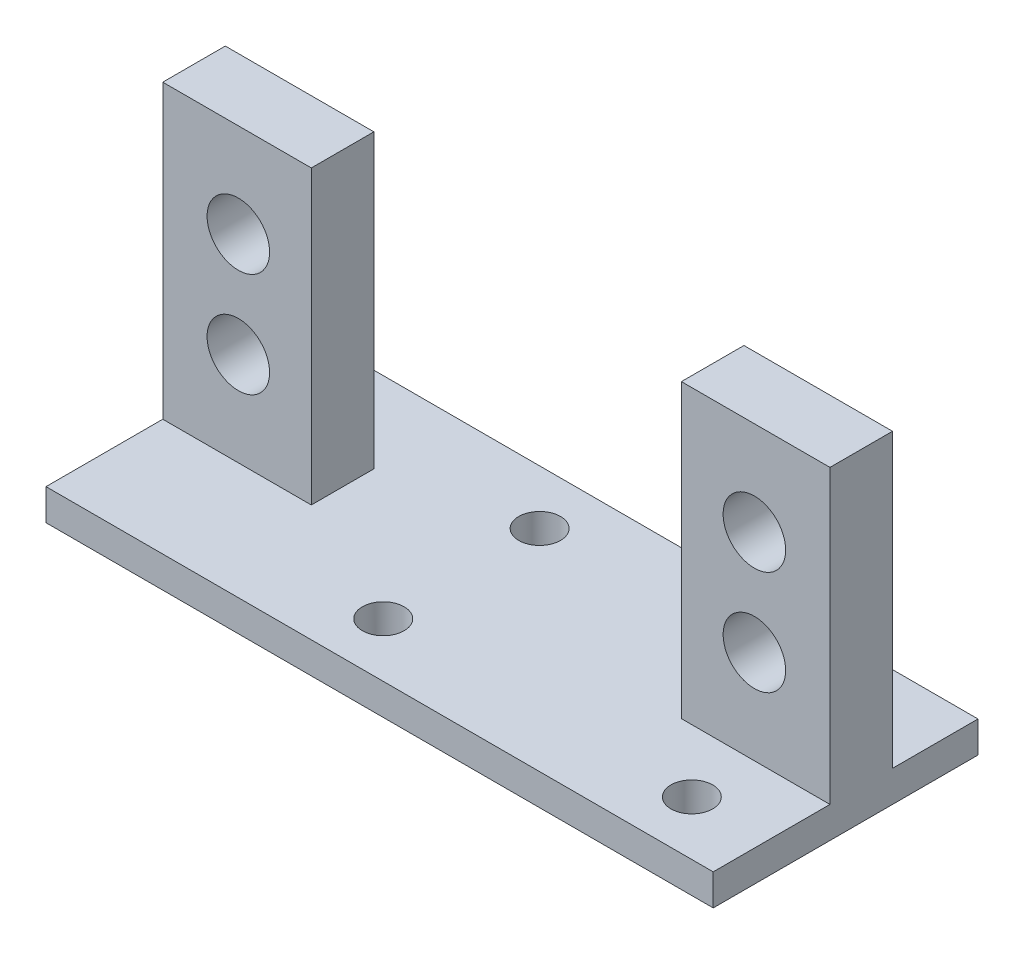
ISO-10303-21;
HEADER;
FILE_DESCRIPTION(('STEP AP214'),'2;1');
FILE_NAME('part.step','',(''),(''),'','','');
FILE_SCHEMA(('AUTOMOTIVE_DESIGN { 1 0 10303 214 1 1 1 1 }'));
ENDSEC;
DATA;
#1=APPLICATION_CONTEXT('core data for automotive mechanical design processes');
#2=APPLICATION_PROTOCOL_DEFINITION('international standard','automotive_design',2000,#1);
#3=PRODUCT_CONTEXT('',#1,'mechanical');
#4=PRODUCT('Part','Part','',(#3));
#5=PRODUCT_RELATED_PRODUCT_CATEGORY('part','',(#4));
#6=PRODUCT_DEFINITION_FORMATION('','',#4);
#7=PRODUCT_DEFINITION_CONTEXT('part definition',#1,'design');
#8=PRODUCT_DEFINITION('design','',#6,#7);
#9=PRODUCT_DEFINITION_SHAPE('','',#8);
#10=(LENGTH_UNIT() NAMED_UNIT(*) SI_UNIT(.MILLI.,.METRE.));
#11=(NAMED_UNIT(*) PLANE_ANGLE_UNIT() SI_UNIT($,.RADIAN.));
#12=(NAMED_UNIT(*) SI_UNIT($,.STERADIAN.) SOLID_ANGLE_UNIT());
#13=UNCERTAINTY_MEASURE_WITH_UNIT(LENGTH_MEASURE(1.E-05),#10,'distance_accuracy_value','');
#14=(GEOMETRIC_REPRESENTATION_CONTEXT(3) GLOBAL_UNCERTAINTY_ASSIGNED_CONTEXT((#13)) GLOBAL_UNIT_ASSIGNED_CONTEXT((#10,
#11,#12)) REPRESENTATION_CONTEXT('',''));
#15=CARTESIAN_POINT('',(0.,0.,0.));
#16=DIRECTION('',(0.,0.,1.));
#17=DIRECTION('',(1.,0.,0.));
#18=AXIS2_PLACEMENT_3D('',#15,#16,#17);
#19=CARTESIAN_POINT('',(0.,3.,0.));
#20=DIRECTION('',(0.,1.,0.));
#21=DIRECTION('',(0.,0.,1.));
#22=AXIS2_PLACEMENT_3D('',#19,#20,#21);
#23=PLANE('',#22);
#24=CARTESIAN_POINT('',(-4.85,3.,7.5));
#25=DIRECTION('',(0.,1.,0.));
#26=DIRECTION('',(0.,0.,-1.));
#27=AXIS2_PLACEMENT_3D('',#24,#25,#26);
#28=CIRCLE('',#27,2.);
#29=CARTESIAN_POINT('',(-4.85,3.,5.5));
#30=VERTEX_POINT('',#29);
#31=EDGE_CURVE('E263',#30,#30,#28,.T.);
#32=ORIENTED_EDGE('',*,*,#31,.F.);
#33=EDGE_LOOP('',(#32));
#34=FACE_BOUND('',#33,.T.);
#35=CARTESIAN_POINT('',(24.75,3.,-7.5));
#36=DIRECTION('',(0.,1.,0.));
#37=DIRECTION('',(0.,0.,-1.));
#38=AXIS2_PLACEMENT_3D('',#35,#36,#37);
#39=CIRCLE('',#38,2.);
#40=CARTESIAN_POINT('',(24.75,3.,-9.5));
#41=VERTEX_POINT('',#40);
#42=EDGE_CURVE('E269',#41,#41,#39,.T.);
#43=ORIENTED_EDGE('',*,*,#42,.F.);
#44=EDGE_LOOP('',(#43));
#45=FACE_BOUND('',#44,.T.);
#46=CARTESIAN_POINT('',(24.75,3.,7.5));
#47=DIRECTION('',(0.,1.,0.));
#48=DIRECTION('',(0.,0.,1.));
#49=AXIS2_PLACEMENT_3D('',#46,#47,#48);
#50=CIRCLE('',#49,2.);
#51=CARTESIAN_POINT('',(24.75,3.,9.5));
#52=VERTEX_POINT('',#51);
#53=EDGE_CURVE('E264',#52,#52,#50,.T.);
#54=ORIENTED_EDGE('',*,*,#53,.F.);
#55=EDGE_LOOP('',(#54));
#56=FACE_BOUND('',#55,.T.);
#57=CARTESIAN_POINT('',(-4.85,3.,-7.5));
#58=DIRECTION('',(0.,1.,0.));
#59=DIRECTION('',(0.,0.,1.));
#60=AXIS2_PLACEMENT_3D('',#57,#58,#59);
#61=CIRCLE('',#60,2.);
#62=CARTESIAN_POINT('',(-4.85,3.,-5.5));
#63=VERTEX_POINT('',#62);
#64=EDGE_CURVE('E268',#63,#63,#61,.T.);
#65=ORIENTED_EDGE('',*,*,#64,.F.);
#66=EDGE_LOOP('',(#65));
#67=FACE_BOUND('',#66,.T.);
#68=DIRECTION('',(-1.,0.,0.));
#69=VECTOR('',#68,1.);
#70=CARTESIAN_POINT('',(-29.,3.,-12.7));
#71=LINE('',#70,#69);
#72=CARTESIAN_POINT('',(32.,3.,-12.7));
#73=VERTEX_POINT('',#72);
#74=CARTESIAN_POINT('',(-32.,3.,-12.7));
#75=VERTEX_POINT('',#74);
#76=EDGE_CURVE('E49',#73,#75,#71,.T.);
#77=ORIENTED_EDGE('',*,*,#76,.T.);
#78=DIRECTION('',(0.,0.,-1.));
#79=VECTOR('',#78,1.);
#80=CARTESIAN_POINT('',(-32.,3.,-12.7));
#81=LINE('',#80,#79);
#82=CARTESIAN_POINT('',(-32.,3.,-4.5));
#83=VERTEX_POINT('',#82);
#84=EDGE_CURVE('E180',#83,#75,#81,.T.);
#85=ORIENTED_EDGE('',*,*,#84,.F.);
#86=DIRECTION('',(-1.,0.,0.));
#87=VECTOR('',#86,1.);
#88=CARTESIAN_POINT('',(-28.75,3.,-4.5));
#89=LINE('',#88,#87);
#90=CARTESIAN_POINT('',(-17.75,3.,-4.5));
#91=VERTEX_POINT('',#90);
#92=EDGE_CURVE('E244',#91,#83,#89,.T.);
#93=ORIENTED_EDGE('',*,*,#92,.F.);
#94=DIRECTION('',(0.,0.,-1.));
#95=VECTOR('',#94,1.);
#96=CARTESIAN_POINT('',(-17.75,3.,-4.5));
#97=LINE('',#96,#95);
#98=CARTESIAN_POINT('',(-17.75,3.,1.5));
#99=VERTEX_POINT('',#98);
#100=EDGE_CURVE('E212',#99,#91,#97,.T.);
#101=ORIENTED_EDGE('',*,*,#100,.F.);
#102=DIRECTION('',(1.,0.,0.));
#103=VECTOR('',#102,1.);
#104=CARTESIAN_POINT('',(-20.75,3.,1.5));
#105=LINE('',#104,#103);
#106=CARTESIAN_POINT('',(-32.,3.,1.5));
#107=VERTEX_POINT('',#106);
#108=EDGE_CURVE('E290',#107,#99,#105,.T.);
#109=ORIENTED_EDGE('',*,*,#108,.F.);
#110=DIRECTION('',(0.,0.,-1.));
#111=VECTOR('',#110,1.);
#112=CARTESIAN_POINT('',(-32.,3.,1.5));
#113=LINE('',#112,#111);
#114=CARTESIAN_POINT('',(-32.,3.,12.7));
#115=VERTEX_POINT('',#114);
#116=EDGE_CURVE('E196',#115,#107,#113,.T.);
#117=ORIENTED_EDGE('',*,*,#116,.F.);
#118=DIRECTION('',(1.,0.,0.));
#119=VECTOR('',#118,1.);
#120=CARTESIAN_POINT('',(-29.,3.,12.7));
#121=LINE('',#120,#119);
#122=CARTESIAN_POINT('',(32.,3.,12.7));
#123=VERTEX_POINT('',#122);
#124=EDGE_CURVE('E11',#115,#123,#121,.T.);
#125=ORIENTED_EDGE('',*,*,#124,.T.);
#126=DIRECTION('',(0.,0.,1.));
#127=VECTOR('',#126,1.);
#128=CARTESIAN_POINT('',(32.,3.,12.7));
#129=LINE('',#128,#127);
#130=CARTESIAN_POINT('',(32.,3.,1.5));
#131=VERTEX_POINT('',#130);
#132=EDGE_CURVE('E142',#131,#123,#129,.T.);
#133=ORIENTED_EDGE('',*,*,#132,.F.);
#134=DIRECTION('',(1.,0.,0.));
#135=VECTOR('',#134,1.);
#136=CARTESIAN_POINT('',(20.75,3.,1.5));
#137=LINE('',#136,#135);
#138=CARTESIAN_POINT('',(17.75,3.,1.5));
#139=VERTEX_POINT('',#138);
#140=EDGE_CURVE('E129',#139,#131,#137,.T.);
#141=ORIENTED_EDGE('',*,*,#140,.F.);
#142=DIRECTION('',(0.,0.,1.));
#143=VECTOR('',#142,1.);
#144=CARTESIAN_POINT('',(17.75,3.,1.5));
#145=LINE('',#144,#143);
#146=CARTESIAN_POINT('',(17.75,3.,-4.5));
#147=VERTEX_POINT('',#146);
#148=EDGE_CURVE('E228',#147,#139,#145,.T.);
#149=ORIENTED_EDGE('',*,*,#148,.F.);
#150=DIRECTION('',(-1.,0.,0.));
#151=VECTOR('',#150,1.);
#152=CARTESIAN_POINT('',(20.75,3.,-4.5));
#153=LINE('',#152,#151);
#154=CARTESIAN_POINT('',(32.,3.,-4.5));
#155=VERTEX_POINT('',#154);
#156=EDGE_CURVE('E258',#155,#147,#153,.T.);
#157=ORIENTED_EDGE('',*,*,#156,.F.);
#158=DIRECTION('',(0.,0.,1.));
#159=VECTOR('',#158,1.);
#160=CARTESIAN_POINT('',(32.,3.,-4.5));
#161=LINE('',#160,#159);
#162=EDGE_CURVE('E167',#73,#155,#161,.T.);
#163=ORIENTED_EDGE('',*,*,#162,.F.);
#164=EDGE_LOOP('',(#77,#85,#93,#101,#109,#117,#125,#133,#141,#149,#157,#163));
#165=FACE_BOUND('',#164,.T.);
#166=ADVANCED_FACE('F39',(#34,#45,#56,#67,#165),#23,.T.);
#167=CARTESIAN_POINT('',(-29.,3.,-12.7));
#168=DIRECTION('',(0.,0.,1.));
#169=DIRECTION('',(1.,0.,0.));
#170=AXIS2_PLACEMENT_3D('',#167,#168,#169);
#171=PLANE('',#170);
#172=DIRECTION('',(-1.,0.,0.));
#173=VECTOR('',#172,1.);
#174=CARTESIAN_POINT('',(-29.,0.,-12.7));
#175=LINE('',#174,#173);
#176=CARTESIAN_POINT('',(32.,0.,-12.7));
#177=VERTEX_POINT('',#176);
#178=CARTESIAN_POINT('',(-32.,0.,-12.7));
#179=VERTEX_POINT('',#178);
#180=EDGE_CURVE('E295',#177,#179,#175,.T.);
#181=ORIENTED_EDGE('',*,*,#180,.T.);
#182=DIRECTION('',(0.,-1.,0.));
#183=VECTOR('',#182,1.);
#184=CARTESIAN_POINT('',(-32.,0.,-12.7));
#185=LINE('',#184,#183);
#186=EDGE_CURVE('E184',#75,#179,#185,.T.);
#187=ORIENTED_EDGE('',*,*,#186,.F.);
#188=ORIENTED_EDGE('',*,*,#76,.F.);
#189=DIRECTION('',(0.,1.,0.));
#190=VECTOR('',#189,1.);
#191=CARTESIAN_POINT('',(32.,3.,-12.7));
#192=LINE('',#191,#190);
#193=EDGE_CURVE('E163',#177,#73,#192,.T.);
#194=ORIENTED_EDGE('',*,*,#193,.F.);
#195=EDGE_LOOP('',(#181,#187,#188,#194));
#196=FACE_BOUND('',#195,.T.);
#197=ADVANCED_FACE('F41',(#196),#171,.F.);
#198=CARTESIAN_POINT('',(-29.,3.,12.7));
#199=DIRECTION('',(0.,0.,-1.));
#200=DIRECTION('',(-1.,0.,0.));
#201=AXIS2_PLACEMENT_3D('',#198,#199,#200);
#202=PLANE('',#201);
#203=DIRECTION('',(1.,0.,0.));
#204=VECTOR('',#203,1.);
#205=CARTESIAN_POINT('',(-29.,0.,12.7));
#206=LINE('',#205,#204);
#207=CARTESIAN_POINT('',(-32.,0.,12.7));
#208=VERTEX_POINT('',#207);
#209=CARTESIAN_POINT('',(32.,0.,12.7));
#210=VERTEX_POINT('',#209);
#211=EDGE_CURVE('E299',#208,#210,#206,.T.);
#212=ORIENTED_EDGE('',*,*,#211,.T.);
#213=DIRECTION('',(0.,-1.,0.));
#214=VECTOR('',#213,1.);
#215=CARTESIAN_POINT('',(32.,0.,12.7));
#216=LINE('',#215,#214);
#217=EDGE_CURVE('E148',#123,#210,#216,.T.);
#218=ORIENTED_EDGE('',*,*,#217,.F.);
#219=ORIENTED_EDGE('',*,*,#124,.F.);
#220=DIRECTION('',(0.,1.,0.));
#221=VECTOR('',#220,1.);
#222=CARTESIAN_POINT('',(-32.,3.,12.7));
#223=LINE('',#222,#221);
#224=EDGE_CURVE('E192',#208,#115,#223,.T.);
#225=ORIENTED_EDGE('',*,*,#224,.F.);
#226=EDGE_LOOP('',(#212,#218,#219,#225));
#227=FACE_BOUND('',#226,.T.);
#228=ADVANCED_FACE('F351',(#227),#202,.F.);
#229=CARTESIAN_POINT('',(0.,0.,0.));
#230=DIRECTION('',(0.,1.,0.));
#231=DIRECTION('',(0.,0.,1.));
#232=AXIS2_PLACEMENT_3D('',#229,#230,#231);
#233=PLANE('',#232);
#234=CARTESIAN_POINT('',(-4.85,0.,7.5));
#235=DIRECTION('',(0.,1.,0.));
#236=DIRECTION('',(0.,0.,1.));
#237=AXIS2_PLACEMENT_3D('',#234,#235,#236);
#238=CIRCLE('',#237,2.);
#239=CARTESIAN_POINT('',(-4.85,0.,9.5));
#240=VERTEX_POINT('',#239);
#241=EDGE_CURVE('E43',#240,#240,#238,.T.);
#242=ORIENTED_EDGE('',*,*,#241,.T.);
#243=EDGE_LOOP('',(#242));
#244=FACE_BOUND('',#243,.T.);
#245=CARTESIAN_POINT('',(24.75,0.,-7.5));
#246=DIRECTION('',(0.,1.,0.));
#247=DIRECTION('',(0.,0.,1.));
#248=AXIS2_PLACEMENT_3D('',#245,#246,#247);
#249=CIRCLE('',#248,2.);
#250=CARTESIAN_POINT('',(24.75,0.,-5.5));
#251=VERTEX_POINT('',#250);
#252=EDGE_CURVE('E317',#251,#251,#249,.T.);
#253=ORIENTED_EDGE('',*,*,#252,.T.);
#254=EDGE_LOOP('',(#253));
#255=FACE_BOUND('',#254,.T.);
#256=CARTESIAN_POINT('',(24.75,0.,7.5));
#257=DIRECTION('',(0.,1.,0.));
#258=DIRECTION('',(0.,0.,1.));
#259=AXIS2_PLACEMENT_3D('',#256,#257,#258);
#260=CIRCLE('',#259,2.);
#261=CARTESIAN_POINT('',(24.75,0.,9.5));
#262=VERTEX_POINT('',#261);
#263=EDGE_CURVE('E314',#262,#262,#260,.T.);
#264=ORIENTED_EDGE('',*,*,#263,.T.);
#265=EDGE_LOOP('',(#264));
#266=FACE_BOUND('',#265,.T.);
#267=CARTESIAN_POINT('',(-4.85,0.,-7.5));
#268=DIRECTION('',(0.,1.,0.));
#269=DIRECTION('',(0.,0.,1.));
#270=AXIS2_PLACEMENT_3D('',#267,#268,#269);
#271=CIRCLE('',#270,2.);
#272=CARTESIAN_POINT('',(-4.85,0.,-5.5));
#273=VERTEX_POINT('',#272);
#274=EDGE_CURVE('E279',#273,#273,#271,.T.);
#275=ORIENTED_EDGE('',*,*,#274,.T.);
#276=EDGE_LOOP('',(#275));
#277=FACE_BOUND('',#276,.T.);
#278=ORIENTED_EDGE('',*,*,#180,.F.);
#279=DIRECTION('',(0.,0.,-1.));
#280=VECTOR('',#279,1.);
#281=CARTESIAN_POINT('',(32.,0.,-12.7));
#282=LINE('',#281,#280);
#283=EDGE_CURVE('E159',#210,#177,#282,.T.);
#284=ORIENTED_EDGE('',*,*,#283,.F.);
#285=ORIENTED_EDGE('',*,*,#211,.F.);
#286=DIRECTION('',(0.,0.,1.));
#287=VECTOR('',#286,1.);
#288=CARTESIAN_POINT('',(-32.,0.,12.7));
#289=LINE('',#288,#287);
#290=EDGE_CURVE('E188',#179,#208,#289,.T.);
#291=ORIENTED_EDGE('',*,*,#290,.F.);
#292=EDGE_LOOP('',(#278,#284,#285,#291));
#293=FACE_BOUND('',#292,.T.);
#294=ADVANCED_FACE('F326',(#244,#255,#266,#277,#293),#233,.F.);
#295=CARTESIAN_POINT('',(-20.75,31.,1.5));
#296=DIRECTION('',(0.,0.,-1.));
#297=DIRECTION('',(-1.,0.,0.));
#298=AXIS2_PLACEMENT_3D('',#295,#296,#297);
#299=PLANE('',#298);
#300=CARTESIAN_POINT('',(-24.75,22.,1.5));
#301=DIRECTION('',(0.,0.,-1.));
#302=DIRECTION('',(-1.,0.,0.));
#303=AXIS2_PLACEMENT_3D('',#300,#301,#302);
#304=CIRCLE('',#303,3.);
#305=CARTESIAN_POINT('',(-27.75,22.,1.5));
#306=VERTEX_POINT('',#305);
#307=EDGE_CURVE('E139',#306,#306,#304,.T.);
#308=ORIENTED_EDGE('',*,*,#307,.T.);
#309=EDGE_LOOP('',(#308));
#310=FACE_BOUND('',#309,.T.);
#311=CARTESIAN_POINT('',(-24.75,12.,1.5));
#312=DIRECTION('',(0.,0.,-1.));
#313=DIRECTION('',(-1.,0.,0.));
#314=AXIS2_PLACEMENT_3D('',#311,#312,#313);
#315=CIRCLE('',#314,3.);
#316=CARTESIAN_POINT('',(-27.75,12.,1.5));
#317=VERTEX_POINT('',#316);
#318=EDGE_CURVE('E288',#317,#317,#315,.T.);
#319=ORIENTED_EDGE('',*,*,#318,.T.);
#320=EDGE_LOOP('',(#319));
#321=FACE_BOUND('',#320,.T.);
#322=ORIENTED_EDGE('',*,*,#108,.T.);
#323=DIRECTION('',(0.,-1.,0.));
#324=VECTOR('',#323,1.);
#325=CARTESIAN_POINT('',(-17.75,3.,1.5));
#326=LINE('',#325,#324);
#327=CARTESIAN_POINT('',(-17.75,31.,1.5));
#328=VERTEX_POINT('',#327);
#329=EDGE_CURVE('E208',#328,#99,#326,.T.);
#330=ORIENTED_EDGE('',*,*,#329,.F.);
#331=DIRECTION('',(1.,0.,0.));
#332=VECTOR('',#331,1.);
#333=CARTESIAN_POINT('',(-20.75,31.,1.5));
#334=LINE('',#333,#332);
#335=CARTESIAN_POINT('',(-32.,31.,1.5));
#336=VERTEX_POINT('',#335);
#337=EDGE_CURVE('E292',#336,#328,#334,.T.);
#338=ORIENTED_EDGE('',*,*,#337,.F.);
#339=DIRECTION('',(0.,1.,0.));
#340=VECTOR('',#339,1.);
#341=CARTESIAN_POINT('',(-32.,31.,1.5));
#342=LINE('',#341,#340);
#343=EDGE_CURVE('E200',#107,#336,#342,.T.);
#344=ORIENTED_EDGE('',*,*,#343,.F.);
#345=EDGE_LOOP('',(#322,#330,#338,#344));
#346=FACE_BOUND('',#345,.T.);
#347=ADVANCED_FACE('F357',(#310,#321,#346),#299,.F.);
#348=CARTESIAN_POINT('',(0.,31.,0.));
#349=DIRECTION('',(0.,-1.,0.));
#350=DIRECTION('',(0.,0.,-1.));
#351=AXIS2_PLACEMENT_3D('',#348,#349,#350);
#352=PLANE('',#351);
#353=ORIENTED_EDGE('',*,*,#337,.T.);
#354=DIRECTION('',(0.,0.,1.));
#355=VECTOR('',#354,1.);
#356=CARTESIAN_POINT('',(-17.75,31.,1.5));
#357=LINE('',#356,#355);
#358=CARTESIAN_POINT('',(-17.75,31.,-4.5));
#359=VERTEX_POINT('',#358);
#360=EDGE_CURVE('E220',#359,#328,#357,.T.);
#361=ORIENTED_EDGE('',*,*,#360,.F.);
#362=DIRECTION('',(1.,0.,0.));
#363=VECTOR('',#362,1.);
#364=CARTESIAN_POINT('',(-20.75,31.,-4.5));
#365=LINE('',#364,#363);
#366=CARTESIAN_POINT('',(-32.,31.,-4.5));
#367=VERTEX_POINT('',#366);
#368=EDGE_CURVE('E247',#367,#359,#365,.T.);
#369=ORIENTED_EDGE('',*,*,#368,.F.);
#370=DIRECTION('',(0.,0.,-1.));
#371=VECTOR('',#370,1.);
#372=CARTESIAN_POINT('',(-32.,31.,-4.5));
#373=LINE('',#372,#371);
#374=EDGE_CURVE('E204',#336,#367,#373,.T.);
#375=ORIENTED_EDGE('',*,*,#374,.F.);
#376=EDGE_LOOP('',(#353,#361,#369,#375));
#377=FACE_BOUND('',#376,.T.);
#378=ADVANCED_FACE('F392',(#377),#352,.F.);
#379=CARTESIAN_POINT('',(20.75,31.,1.5));
#380=DIRECTION('',(0.,0.,-1.));
#381=DIRECTION('',(-1.,0.,0.));
#382=AXIS2_PLACEMENT_3D('',#379,#380,#381);
#383=PLANE('',#382);
#384=CARTESIAN_POINT('',(24.75,12.,1.5));
#385=DIRECTION('',(0.,0.,-1.));
#386=DIRECTION('',(-1.,0.,0.));
#387=AXIS2_PLACEMENT_3D('',#384,#385,#386);
#388=CIRCLE('',#387,3.);
#389=CARTESIAN_POINT('',(21.75,12.,1.5));
#390=VERTEX_POINT('',#389);
#391=EDGE_CURVE('E284',#390,#390,#388,.T.);
#392=ORIENTED_EDGE('',*,*,#391,.T.);
#393=EDGE_LOOP('',(#392));
#394=FACE_BOUND('',#393,.T.);
#395=CARTESIAN_POINT('',(24.75,22.,1.5));
#396=DIRECTION('',(0.,0.,-1.));
#397=DIRECTION('',(-1.,0.,0.));
#398=AXIS2_PLACEMENT_3D('',#395,#396,#397);
#399=CIRCLE('',#398,3.);
#400=CARTESIAN_POINT('',(21.75,22.,1.5));
#401=VERTEX_POINT('',#400);
#402=EDGE_CURVE('E280',#401,#401,#399,.T.);
#403=ORIENTED_EDGE('',*,*,#402,.T.);
#404=EDGE_LOOP('',(#403));
#405=FACE_BOUND('',#404,.T.);
#406=ORIENTED_EDGE('',*,*,#140,.T.);
#407=DIRECTION('',(0.,-1.,0.));
#408=VECTOR('',#407,1.);
#409=CARTESIAN_POINT('',(32.,3.,1.5));
#410=LINE('',#409,#408);
#411=CARTESIAN_POINT('',(32.,31.,1.5));
#412=VERTEX_POINT('',#411);
#413=EDGE_CURVE('E133',#412,#131,#410,.T.);
#414=ORIENTED_EDGE('',*,*,#413,.F.);
#415=DIRECTION('',(1.,0.,0.));
#416=VECTOR('',#415,1.);
#417=CARTESIAN_POINT('',(20.75,31.,1.5));
#418=LINE('',#417,#416);
#419=CARTESIAN_POINT('',(17.75,31.,1.5));
#420=VERTEX_POINT('',#419);
#421=EDGE_CURVE('E65',#420,#412,#418,.T.);
#422=ORIENTED_EDGE('',*,*,#421,.F.);
#423=DIRECTION('',(0.,1.,0.));
#424=VECTOR('',#423,1.);
#425=CARTESIAN_POINT('',(17.75,31.,1.5));
#426=LINE('',#425,#424);
#427=EDGE_CURVE('E134',#139,#420,#426,.T.);
#428=ORIENTED_EDGE('',*,*,#427,.F.);
#429=EDGE_LOOP('',(#406,#414,#422,#428));
#430=FACE_BOUND('',#429,.T.);
#431=ADVANCED_FACE('F131',(#394,#405,#430),#383,.F.);
#432=CARTESIAN_POINT('',(0.,31.,0.));
#433=DIRECTION('',(0.,1.,0.));
#434=DIRECTION('',(0.,0.,1.));
#435=AXIS2_PLACEMENT_3D('',#432,#433,#434);
#436=PLANE('',#435);
#437=ORIENTED_EDGE('',*,*,#421,.T.);
#438=DIRECTION('',(0.,0.,1.));
#439=VECTOR('',#438,1.);
#440=CARTESIAN_POINT('',(32.,31.,1.5));
#441=LINE('',#440,#439);
#442=CARTESIAN_POINT('',(32.,31.,-4.5));
#443=VERTEX_POINT('',#442);
#444=EDGE_CURVE('E153',#443,#412,#441,.T.);
#445=ORIENTED_EDGE('',*,*,#444,.F.);
#446=DIRECTION('',(1.,0.,0.));
#447=VECTOR('',#446,1.);
#448=CARTESIAN_POINT('',(28.75,31.,-4.5));
#449=LINE('',#448,#447);
#450=CARTESIAN_POINT('',(17.75,31.,-4.5));
#451=VERTEX_POINT('',#450);
#452=EDGE_CURVE('E57',#451,#443,#449,.T.);
#453=ORIENTED_EDGE('',*,*,#452,.F.);
#454=DIRECTION('',(0.,0.,-1.));
#455=VECTOR('',#454,1.);
#456=CARTESIAN_POINT('',(17.75,31.,-4.5));
#457=LINE('',#456,#455);
#458=EDGE_CURVE('E233',#420,#451,#457,.T.);
#459=ORIENTED_EDGE('',*,*,#458,.F.);
#460=EDGE_LOOP('',(#437,#445,#453,#459));
#461=FACE_BOUND('',#460,.T.);
#462=ADVANCED_FACE('F381',(#461),#436,.T.);
#463=CARTESIAN_POINT('',(24.75,22.,-21.7));
#464=DIRECTION('',(0.,0.,1.));
#465=DIRECTION('',(1.,0.,0.));
#466=AXIS2_PLACEMENT_3D('',#463,#464,#465);
#467=CYLINDRICAL_SURFACE('',#466,3.);
#468=ORIENTED_EDGE('',*,*,#402,.F.);
#469=EDGE_LOOP('',(#468));
#470=FACE_BOUND('',#469,.T.);
#471=CARTESIAN_POINT('',(24.75,22.,-4.5));
#472=DIRECTION('',(0.,0.,-1.));
#473=DIRECTION('',(-1.,0.,0.));
#474=AXIS2_PLACEMENT_3D('',#471,#472,#473);
#475=CIRCLE('',#474,3.);
#476=CARTESIAN_POINT('',(21.75,22.,-4.5));
#477=VERTEX_POINT('',#476);
#478=EDGE_CURVE('E254',#477,#477,#475,.T.);
#479=ORIENTED_EDGE('',*,*,#478,.T.);
#480=EDGE_LOOP('',(#479));
#481=FACE_BOUND('',#480,.T.);
#482=ADVANCED_FACE('F383',(#470,#481),#467,.F.);
#483=CARTESIAN_POINT('',(24.75,12.,-21.7));
#484=DIRECTION('',(0.,0.,1.));
#485=DIRECTION('',(1.,0.,0.));
#486=AXIS2_PLACEMENT_3D('',#483,#484,#485);
#487=CYLINDRICAL_SURFACE('',#486,3.);
#488=ORIENTED_EDGE('',*,*,#391,.F.);
#489=EDGE_LOOP('',(#488));
#490=FACE_BOUND('',#489,.T.);
#491=CARTESIAN_POINT('',(24.75,12.,-4.5));
#492=DIRECTION('',(0.,0.,-1.));
#493=DIRECTION('',(-1.,0.,0.));
#494=AXIS2_PLACEMENT_3D('',#491,#492,#493);
#495=CIRCLE('',#494,3.);
#496=CARTESIAN_POINT('',(21.75,12.,-4.5));
#497=VERTEX_POINT('',#496);
#498=EDGE_CURVE('E250',#497,#497,#495,.T.);
#499=ORIENTED_EDGE('',*,*,#498,.T.);
#500=EDGE_LOOP('',(#499));
#501=FACE_BOUND('',#500,.T.);
#502=ADVANCED_FACE('F389',(#490,#501),#487,.F.);
#503=CARTESIAN_POINT('',(-24.75,12.,-21.7));
#504=DIRECTION('',(0.,0.,1.));
#505=DIRECTION('',(1.,0.,0.));
#506=AXIS2_PLACEMENT_3D('',#503,#504,#505);
#507=CYLINDRICAL_SURFACE('',#506,3.);
#508=ORIENTED_EDGE('',*,*,#318,.F.);
#509=EDGE_LOOP('',(#508));
#510=FACE_BOUND('',#509,.T.);
#511=CARTESIAN_POINT('',(-24.75,12.,-4.5));
#512=DIRECTION('',(0.,0.,-1.));
#513=DIRECTION('',(-1.,0.,0.));
#514=AXIS2_PLACEMENT_3D('',#511,#512,#513);
#515=CIRCLE('',#514,3.);
#516=CARTESIAN_POINT('',(-27.75,12.,-4.5));
#517=VERTEX_POINT('',#516);
#518=EDGE_CURVE('E236',#517,#517,#515,.T.);
#519=ORIENTED_EDGE('',*,*,#518,.T.);
#520=EDGE_LOOP('',(#519));
#521=FACE_BOUND('',#520,.T.);
#522=ADVANCED_FACE('F396',(#510,#521),#507,.F.);
#523=CARTESIAN_POINT('',(-24.75,22.,-21.7));
#524=DIRECTION('',(0.,0.,1.));
#525=DIRECTION('',(1.,0.,0.));
#526=AXIS2_PLACEMENT_3D('',#523,#524,#525);
#527=CYLINDRICAL_SURFACE('',#526,3.);
#528=ORIENTED_EDGE('',*,*,#307,.F.);
#529=EDGE_LOOP('',(#528));
#530=FACE_BOUND('',#529,.T.);
#531=CARTESIAN_POINT('',(-24.75,22.,-4.5));
#532=DIRECTION('',(0.,0.,-1.));
#533=DIRECTION('',(-1.,0.,0.));
#534=AXIS2_PLACEMENT_3D('',#531,#532,#533);
#535=CIRCLE('',#534,3.);
#536=CARTESIAN_POINT('',(-27.75,22.,-4.5));
#537=VERTEX_POINT('',#536);
#538=EDGE_CURVE('E240',#537,#537,#535,.T.);
#539=ORIENTED_EDGE('',*,*,#538,.T.);
#540=EDGE_LOOP('',(#539));
#541=FACE_BOUND('',#540,.T.);
#542=ADVANCED_FACE('F421',(#530,#541),#527,.F.);
#543=CARTESIAN_POINT('',(-4.85,-19.,-7.5));
#544=DIRECTION('',(0.,1.,0.));
#545=DIRECTION('',(0.,0.,1.));
#546=AXIS2_PLACEMENT_3D('',#543,#544,#545);
#547=CYLINDRICAL_SURFACE('',#546,2.);
#548=ORIENTED_EDGE('',*,*,#64,.T.);
#549=EDGE_LOOP('',(#548));
#550=FACE_BOUND('',#549,.T.);
#551=ORIENTED_EDGE('',*,*,#274,.F.);
#552=EDGE_LOOP('',(#551));
#553=FACE_BOUND('',#552,.T.);
#554=ADVANCED_FACE('F427',(#550,#553),#547,.F.);
#555=CARTESIAN_POINT('',(24.75,-19.,7.5));
#556=DIRECTION('',(0.,1.,0.));
#557=DIRECTION('',(0.,0.,1.));
#558=AXIS2_PLACEMENT_3D('',#555,#556,#557);
#559=CYLINDRICAL_SURFACE('',#558,2.);
#560=ORIENTED_EDGE('',*,*,#53,.T.);
#561=EDGE_LOOP('',(#560));
#562=FACE_BOUND('',#561,.T.);
#563=ORIENTED_EDGE('',*,*,#263,.F.);
#564=EDGE_LOOP('',(#563));
#565=FACE_BOUND('',#564,.T.);
#566=ADVANCED_FACE('F341',(#562,#565),#559,.F.);
#567=CARTESIAN_POINT('',(24.75,-19.,-7.5));
#568=DIRECTION('',(0.,1.,0.));
#569=DIRECTION('',(0.,0.,1.));
#570=AXIS2_PLACEMENT_3D('',#567,#568,#569);
#571=CYLINDRICAL_SURFACE('',#570,2.);
#572=ORIENTED_EDGE('',*,*,#42,.T.);
#573=EDGE_LOOP('',(#572));
#574=FACE_BOUND('',#573,.T.);
#575=ORIENTED_EDGE('',*,*,#252,.F.);
#576=EDGE_LOOP('',(#575));
#577=FACE_BOUND('',#576,.T.);
#578=ADVANCED_FACE('F331',(#574,#577),#571,.F.);
#579=CARTESIAN_POINT('',(-4.85,-19.,7.5));
#580=DIRECTION('',(0.,1.,0.));
#581=DIRECTION('',(0.,0.,1.));
#582=AXIS2_PLACEMENT_3D('',#579,#580,#581);
#583=CYLINDRICAL_SURFACE('',#582,2.);
#584=ORIENTED_EDGE('',*,*,#31,.T.);
#585=EDGE_LOOP('',(#584));
#586=FACE_BOUND('',#585,.T.);
#587=ORIENTED_EDGE('',*,*,#241,.F.);
#588=EDGE_LOOP('',(#587));
#589=FACE_BOUND('',#588,.T.);
#590=ADVANCED_FACE('F328',(#586,#589),#583,.F.);
#591=CARTESIAN_POINT('',(0.,0.,-4.5));
#592=DIRECTION('',(0.,0.,1.));
#593=DIRECTION('',(1.,0.,0.));
#594=AXIS2_PLACEMENT_3D('',#591,#592,#593);
#595=PLANE('',#594);
#596=ORIENTED_EDGE('',*,*,#156,.T.);
#597=DIRECTION('',(0.,-1.,0.));
#598=VECTOR('',#597,1.);
#599=CARTESIAN_POINT('',(17.75,3.,-4.5));
#600=LINE('',#599,#598);
#601=EDGE_CURVE('E224',#451,#147,#600,.T.);
#602=ORIENTED_EDGE('',*,*,#601,.F.);
#603=ORIENTED_EDGE('',*,*,#452,.T.);
#604=DIRECTION('',(0.,1.,0.));
#605=VECTOR('',#604,1.);
#606=CARTESIAN_POINT('',(32.,31.,-4.5));
#607=LINE('',#606,#605);
#608=EDGE_CURVE('E171',#155,#443,#607,.T.);
#609=ORIENTED_EDGE('',*,*,#608,.F.);
#610=EDGE_LOOP('',(#596,#602,#603,#609));
#611=FACE_BOUND('',#610,.T.);
#612=ORIENTED_EDGE('',*,*,#478,.F.);
#613=EDGE_LOOP('',(#612));
#614=FACE_BOUND('',#613,.T.);
#615=ORIENTED_EDGE('',*,*,#498,.F.);
#616=EDGE_LOOP('',(#615));
#617=FACE_BOUND('',#616,.T.);
#618=ADVANCED_FACE('F330',(#611,#614,#617),#595,.F.);
#619=CARTESIAN_POINT('',(0.,0.,-4.5));
#620=DIRECTION('',(0.,0.,1.));
#621=DIRECTION('',(1.,0.,0.));
#622=AXIS2_PLACEMENT_3D('',#619,#620,#621);
#623=PLANE('',#622);
#624=ORIENTED_EDGE('',*,*,#368,.T.);
#625=DIRECTION('',(0.,1.,0.));
#626=VECTOR('',#625,1.);
#627=CARTESIAN_POINT('',(-17.75,31.,-4.5));
#628=LINE('',#627,#626);
#629=EDGE_CURVE('E216',#91,#359,#628,.T.);
#630=ORIENTED_EDGE('',*,*,#629,.F.);
#631=ORIENTED_EDGE('',*,*,#92,.T.);
#632=DIRECTION('',(0.,-1.,0.));
#633=VECTOR('',#632,1.);
#634=CARTESIAN_POINT('',(-32.,3.,-4.5));
#635=LINE('',#634,#633);
#636=EDGE_CURVE('E176',#367,#83,#635,.T.);
#637=ORIENTED_EDGE('',*,*,#636,.F.);
#638=EDGE_LOOP('',(#624,#630,#631,#637));
#639=FACE_BOUND('',#638,.T.);
#640=ORIENTED_EDGE('',*,*,#538,.F.);
#641=EDGE_LOOP('',(#640));
#642=FACE_BOUND('',#641,.T.);
#643=ORIENTED_EDGE('',*,*,#518,.F.);
#644=EDGE_LOOP('',(#643));
#645=FACE_BOUND('',#644,.T.);
#646=ADVANCED_FACE('F338',(#639,#642,#645),#623,.F.);
#647=CARTESIAN_POINT('',(17.75,0.,0.));
#648=DIRECTION('',(1.,0.,0.));
#649=DIRECTION('',(0.,0.,-1.));
#650=AXIS2_PLACEMENT_3D('',#647,#648,#649);
#651=PLANE('',#650);
#652=ORIENTED_EDGE('',*,*,#601,.T.);
#653=ORIENTED_EDGE('',*,*,#148,.T.);
#654=ORIENTED_EDGE('',*,*,#427,.T.);
#655=ORIENTED_EDGE('',*,*,#458,.T.);
#656=EDGE_LOOP('',(#652,#653,#654,#655));
#657=FACE_BOUND('',#656,.T.);
#658=ADVANCED_FACE('F380',(#657),#651,.F.);
#659=CARTESIAN_POINT('',(-17.75,0.,0.));
#660=DIRECTION('',(-1.,0.,0.));
#661=DIRECTION('',(0.,0.,1.));
#662=AXIS2_PLACEMENT_3D('',#659,#660,#661);
#663=PLANE('',#662);
#664=ORIENTED_EDGE('',*,*,#329,.T.);
#665=ORIENTED_EDGE('',*,*,#100,.T.);
#666=ORIENTED_EDGE('',*,*,#629,.T.);
#667=ORIENTED_EDGE('',*,*,#360,.T.);
#668=EDGE_LOOP('',(#664,#665,#666,#667));
#669=FACE_BOUND('',#668,.T.);
#670=ADVANCED_FACE('F410',(#669),#663,.F.);
#671=CARTESIAN_POINT('',(-32.,0.,0.));
#672=DIRECTION('',(1.,0.,0.));
#673=DIRECTION('',(0.,0.,-1.));
#674=AXIS2_PLACEMENT_3D('',#671,#672,#673);
#675=PLANE('',#674);
#676=ORIENTED_EDGE('',*,*,#636,.T.);
#677=ORIENTED_EDGE('',*,*,#84,.T.);
#678=ORIENTED_EDGE('',*,*,#186,.T.);
#679=ORIENTED_EDGE('',*,*,#290,.T.);
#680=ORIENTED_EDGE('',*,*,#224,.T.);
#681=ORIENTED_EDGE('',*,*,#116,.T.);
#682=ORIENTED_EDGE('',*,*,#343,.T.);
#683=ORIENTED_EDGE('',*,*,#374,.T.);
#684=EDGE_LOOP('',(#676,#677,#678,#679,#680,#681,#682,#683));
#685=FACE_BOUND('',#684,.T.);
#686=ADVANCED_FACE('F371',(#685),#675,.F.);
#687=CARTESIAN_POINT('',(32.,0.,0.));
#688=DIRECTION('',(-1.,0.,0.));
#689=DIRECTION('',(0.,0.,1.));
#690=AXIS2_PLACEMENT_3D('',#687,#688,#689);
#691=PLANE('',#690);
#692=ORIENTED_EDGE('',*,*,#413,.T.);
#693=ORIENTED_EDGE('',*,*,#132,.T.);
#694=ORIENTED_EDGE('',*,*,#217,.T.);
#695=ORIENTED_EDGE('',*,*,#283,.T.);
#696=ORIENTED_EDGE('',*,*,#193,.T.);
#697=ORIENTED_EDGE('',*,*,#162,.T.);
#698=ORIENTED_EDGE('',*,*,#608,.T.);
#699=ORIENTED_EDGE('',*,*,#444,.T.);
#700=EDGE_LOOP('',(#692,#693,#694,#695,#696,#697,#698,#699));
#701=FACE_BOUND('',#700,.T.);
#702=ADVANCED_FACE('F151',(#701),#691,.F.);
#703=CLOSED_SHELL('',(#166,#197,#228,#294,#347,#378,#431,#462,#482,#502,#522,#542,#554,#566,
#578,#590,#618,#646,#658,#670,#686,#702));
#704=MANIFOLD_SOLID_BREP('B2',#703);
#705=ADVANCED_BREP_SHAPE_REPRESENTATION('',(#18,#704),#14);
#706=SHAPE_DEFINITION_REPRESENTATION(#9,#705);
ENDSEC;
END-ISO-10303-21;
